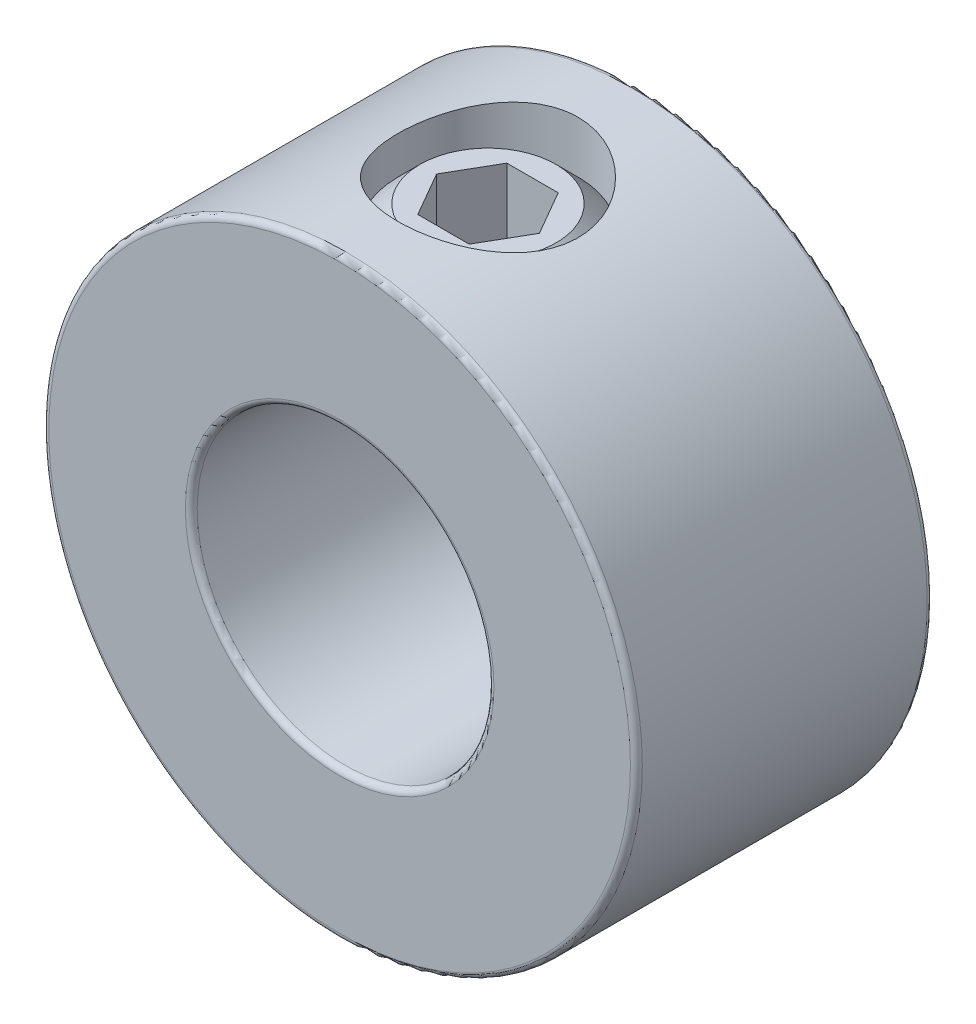
ISO-10303-21;
HEADER;
FILE_DESCRIPTION(('STEP AP214'),'2;1');
FILE_NAME('part.step','',(''),(''),'','','');
FILE_SCHEMA(('AUTOMOTIVE_DESIGN { 1 0 10303 214 1 1 1 1 }'));
ENDSEC;
DATA;
#1=APPLICATION_CONTEXT('core data for automotive mechanical design processes');
#2=APPLICATION_PROTOCOL_DEFINITION('international standard','automotive_design',2000,#1);
#3=PRODUCT_CONTEXT('',#1,'mechanical');
#4=PRODUCT('Part','Part','',(#3));
#5=PRODUCT_RELATED_PRODUCT_CATEGORY('part','',(#4));
#6=PRODUCT_DEFINITION_FORMATION('','',#4);
#7=PRODUCT_DEFINITION_CONTEXT('part definition',#1,'design');
#8=PRODUCT_DEFINITION('design','',#6,#7);
#9=PRODUCT_DEFINITION_SHAPE('','',#8);
#10=(LENGTH_UNIT() NAMED_UNIT(*) SI_UNIT(.MILLI.,.METRE.));
#11=(NAMED_UNIT(*) PLANE_ANGLE_UNIT() SI_UNIT($,.RADIAN.));
#12=(NAMED_UNIT(*) SI_UNIT($,.STERADIAN.) SOLID_ANGLE_UNIT());
#13=UNCERTAINTY_MEASURE_WITH_UNIT(LENGTH_MEASURE(1.E-05),#10,'distance_accuracy_value','');
#14=(GEOMETRIC_REPRESENTATION_CONTEXT(3) GLOBAL_UNCERTAINTY_ASSIGNED_CONTEXT((#13)) GLOBAL_UNIT_ASSIGNED_CONTEXT((#10,
#11,#12)) REPRESENTATION_CONTEXT('',''));
#15=CARTESIAN_POINT('',(0.,0.,0.));
#16=DIRECTION('',(0.,0.,1.));
#17=DIRECTION('',(1.,0.,0.));
#18=AXIS2_PLACEMENT_3D('',#15,#16,#17);
#19=CARTESIAN_POINT('',(0.,7.14375,0.));
#20=DIRECTION('',(0.,1.,0.));
#21=DIRECTION('',(-1.,0.,0.));
#22=AXIS2_PLACEMENT_3D('',#19,#20,#21);
#23=PLANE('',#22);
#24=CARTESIAN_POINT('',(0.,7.14375,0.));
#25=DIRECTION('',(0.,1.,0.));
#26=DIRECTION('',(-1.,0.,0.));
#27=AXIS2_PLACEMENT_3D('',#24,#25,#26);
#28=CIRCLE('',#27,1.81975161629017);
#29=CARTESIAN_POINT('',(-1.81975161629017,7.14375,0.));
#30=VERTEX_POINT('',#29);
#31=EDGE_CURVE('E12',#30,#30,#28,.T.);
#32=ORIENTED_EDGE('',*,*,#31,.T.);
#33=EDGE_LOOP('',(#32));
#34=FACE_BOUND('',#33,.T.);
#35=DIRECTION('',(1.,0.,0.));
#36=VECTOR('',#35,1.);
#37=CARTESIAN_POINT('',(-0.687407664253899,7.14374999999999,-1.190625));
#38=LINE('',#37,#36);
#39=CARTESIAN_POINT('',(-0.687407664253899,7.14374999999999,-1.190625));
#40=VERTEX_POINT('',#39);
#41=CARTESIAN_POINT('',(0.687407664253899,7.14375,-1.190625));
#42=VERTEX_POINT('',#41);
#43=EDGE_CURVE('E124',#40,#42,#38,.T.);
#44=ORIENTED_EDGE('',*,*,#43,.T.);
#45=DIRECTION('',(0.5,0.,0.866025403784439));
#46=VECTOR('',#45,1.);
#47=CARTESIAN_POINT('',(0.687407664253899,7.14374999999999,-1.190625));
#48=LINE('',#47,#46);
#49=CARTESIAN_POINT('',(1.3748153285078,7.14374999999999,0.));
#50=VERTEX_POINT('',#49);
#51=EDGE_CURVE('E68',#42,#50,#48,.T.);
#52=ORIENTED_EDGE('',*,*,#51,.T.);
#53=DIRECTION('',(-0.5,0.,0.866025403784439));
#54=VECTOR('',#53,1.);
#55=CARTESIAN_POINT('',(1.3748153285078,7.14374999999999,0.));
#56=LINE('',#55,#54);
#57=CARTESIAN_POINT('',(0.687407664253899,7.14374999999999,1.190625));
#58=VERTEX_POINT('',#57);
#59=EDGE_CURVE('E128',#50,#58,#56,.T.);
#60=ORIENTED_EDGE('',*,*,#59,.T.);
#61=DIRECTION('',(-1.,0.,0.));
#62=VECTOR('',#61,1.);
#63=CARTESIAN_POINT('',(0.687407664253899,7.14374999999999,1.190625));
#64=LINE('',#63,#62);
#65=CARTESIAN_POINT('',(-0.687407664253899,7.14374999999999,1.190625));
#66=VERTEX_POINT('',#65);
#67=EDGE_CURVE('E207',#58,#66,#64,.T.);
#68=ORIENTED_EDGE('',*,*,#67,.T.);
#69=DIRECTION('',(-0.5,0.,-0.866025403784439));
#70=VECTOR('',#69,1.);
#71=CARTESIAN_POINT('',(-0.687407664253899,7.14374999999999,1.190625));
#72=LINE('',#71,#70);
#73=CARTESIAN_POINT('',(-1.3748153285078,7.14374999999999,0.));
#74=VERTEX_POINT('',#73);
#75=EDGE_CURVE('E187',#66,#74,#72,.T.);
#76=ORIENTED_EDGE('',*,*,#75,.T.);
#77=DIRECTION('',(0.5,0.,-0.866025403784439));
#78=VECTOR('',#77,1.);
#79=CARTESIAN_POINT('',(-1.3748153285078,7.14374999999999,0.));
#80=LINE('',#79,#78);
#81=EDGE_CURVE('E180',#74,#40,#80,.T.);
#82=ORIENTED_EDGE('',*,*,#81,.T.);
#83=EDGE_LOOP('',(#44,#52,#60,#68,#76,#82));
#84=FACE_BOUND('',#83,.T.);
#85=ADVANCED_FACE('F53',(#34,#84),#23,.T.);
#86=CARTESIAN_POINT('',(0.,7.14375,0.));
#87=DIRECTION('',(0.,-1.,0.));
#88=DIRECTION('',(1.,0.,0.));
#89=AXIS2_PLACEMENT_3D('',#86,#87,#88);
#90=CONICAL_SURFACE('',#89,1.81975161629017,0.785398163397449);
#91=CARTESIAN_POINT('',(0.,6.55050161629017,0.));
#92=DIRECTION('',(0.,1.,0.));
#93=DIRECTION('',(-1.,0.,0.));
#94=AXIS2_PLACEMENT_3D('',#91,#92,#93);
#95=CIRCLE('',#94,2.413);
#96=CARTESIAN_POINT('',(-2.413,6.55050161629017,0.));
#97=VERTEX_POINT('',#96);
#98=EDGE_CURVE('E61',#97,#97,#95,.T.);
#99=ORIENTED_EDGE('',*,*,#98,.T.);
#100=EDGE_LOOP('',(#99));
#101=FACE_BOUND('',#100,.T.);
#102=ORIENTED_EDGE('',*,*,#31,.F.);
#103=EDGE_LOOP('',(#102));
#104=FACE_BOUND('',#103,.T.);
#105=ADVANCED_FACE('F154',(#101,#104),#90,.T.);
#106=CARTESIAN_POINT('',(0.,3.96875,0.));
#107=DIRECTION('',(0.,1.,0.));
#108=DIRECTION('',(-1.,0.,0.));
#109=AXIS2_PLACEMENT_3D('',#106,#107,#108);
#110=CYLINDRICAL_SURFACE('',#109,2.413);
#111=CARTESIAN_POINT('',(0.,4.56199838370983,0.));
#112=DIRECTION('',(0.,1.,0.));
#113=DIRECTION('',(-1.,0.,0.));
#114=AXIS2_PLACEMENT_3D('',#111,#112,#113);
#115=CIRCLE('',#114,2.413);
#116=CARTESIAN_POINT('',(-2.413,4.56199838370983,0.));
#117=VERTEX_POINT('',#116);
#118=EDGE_CURVE('E146',#117,#117,#115,.T.);
#119=ORIENTED_EDGE('',*,*,#118,.T.);
#120=EDGE_LOOP('',(#119));
#121=FACE_BOUND('',#120,.T.);
#122=ORIENTED_EDGE('',*,*,#98,.F.);
#123=EDGE_LOOP('',(#122));
#124=FACE_BOUND('',#123,.T.);
#125=ADVANCED_FACE('F157',(#121,#124),#110,.T.);
#126=CARTESIAN_POINT('',(0.,4.56199838370983,0.));
#127=DIRECTION('',(0.,1.,0.));
#128=DIRECTION('',(-1.,0.,0.));
#129=AXIS2_PLACEMENT_3D('',#126,#127,#128);
#130=CONICAL_SURFACE('',#129,2.413,0.785398163397449);
#131=CARTESIAN_POINT('',(0.,3.96875,0.));
#132=DIRECTION('',(0.,1.,0.));
#133=DIRECTION('',(-1.,0.,0.));
#134=AXIS2_PLACEMENT_3D('',#131,#132,#133);
#135=CIRCLE('',#134,1.81975161629017);
#136=CARTESIAN_POINT('',(-1.81975161629017,3.96875,0.));
#137=VERTEX_POINT('',#136);
#138=EDGE_CURVE('E137',#137,#137,#135,.T.);
#139=ORIENTED_EDGE('',*,*,#138,.T.);
#140=EDGE_LOOP('',(#139));
#141=FACE_BOUND('',#140,.T.);
#142=ORIENTED_EDGE('',*,*,#118,.F.);
#143=EDGE_LOOP('',(#142));
#144=FACE_BOUND('',#143,.T.);
#145=ADVANCED_FACE('F159',(#141,#144),#130,.T.);
#146=CARTESIAN_POINT('',(-1.81975161629017,3.96875,0.));
#147=DIRECTION('',(0.,-1.,0.));
#148=DIRECTION('',(1.,0.,0.));
#149=AXIS2_PLACEMENT_3D('',#146,#147,#148);
#150=PLANE('',#149);
#151=CARTESIAN_POINT('',(0.,3.96875,0.));
#152=DIRECTION('',(0.,1.,0.));
#153=DIRECTION('',(-1.,0.,0.));
#154=AXIS2_PLACEMENT_3D('',#151,#152,#153);
#155=CIRCLE('',#154,0.711898060451796);
#156=CARTESIAN_POINT('',(-0.711898060451796,3.96875,0.));
#157=VERTEX_POINT('',#156);
#158=EDGE_CURVE('E130',#157,#157,#155,.T.);
#159=ORIENTED_EDGE('',*,*,#158,.T.);
#160=EDGE_LOOP('',(#159));
#161=FACE_BOUND('',#160,.T.);
#162=ORIENTED_EDGE('',*,*,#138,.F.);
#163=EDGE_LOOP('',(#162));
#164=FACE_BOUND('',#163,.T.);
#165=ADVANCED_FACE('F166',(#161,#164),#150,.T.);
#166=CARTESIAN_POINT('',(0.,3.96875,0.));
#167=DIRECTION('',(0.,-1.,0.));
#168=DIRECTION('',(1.,0.,0.));
#169=AXIS2_PLACEMENT_3D('',#166,#167,#168);
#170=CONICAL_SURFACE('',#169,0.711898060451796,0.785398163397448);
#171=CARTESIAN_POINT('',(0.,4.6806480604518,0.));
#172=VERTEX_POINT('',#171);
#173=VERTEX_LOOP('',#172);
#174=FACE_BOUND('',#173,.T.);
#175=ORIENTED_EDGE('',*,*,#158,.F.);
#176=EDGE_LOOP('',(#175));
#177=FACE_BOUND('',#176,.T.);
#178=ADVANCED_FACE('F259',(#174,#177),#170,.F.);
#179=CARTESIAN_POINT('',(0.687407664253899,4.76249999999999,-1.190625));
#180=DIRECTION('',(-0.866025403784439,0.,0.5));
#181=DIRECTION('',(0.5,0.,0.866025403784438));
#182=AXIS2_PLACEMENT_3D('',#179,#180,#181);
#183=PLANE('',#182);
#184=ORIENTED_EDGE('',*,*,#51,.F.);
#185=DIRECTION('',(0.,1.,0.));
#186=VECTOR('',#185,1.);
#187=CARTESIAN_POINT('',(0.687407664253899,4.76249999999999,-1.190625));
#188=LINE('',#187,#186);
#189=CARTESIAN_POINT('',(0.687407664253899,4.76249999999999,-1.190625));
#190=VERTEX_POINT('',#189);
#191=EDGE_CURVE('E122',#190,#42,#188,.T.);
#192=ORIENTED_EDGE('',*,*,#191,.F.);
#193=DIRECTION('',(0.5,0.,0.866025403784439));
#194=VECTOR('',#193,1.);
#195=CARTESIAN_POINT('',(0.687407664253899,4.76249999999999,-1.190625));
#196=LINE('',#195,#194);
#197=CARTESIAN_POINT('',(1.3748153285078,4.76249999999999,0.));
#198=VERTEX_POINT('',#197);
#199=EDGE_CURVE('E112',#190,#198,#196,.T.);
#200=ORIENTED_EDGE('',*,*,#199,.T.);
#201=DIRECTION('',(0.,1.,0.));
#202=VECTOR('',#201,1.);
#203=CARTESIAN_POINT('',(1.3748153285078,4.76249999999999,0.));
#204=LINE('',#203,#202);
#205=EDGE_CURVE('E121',#198,#50,#204,.T.);
#206=ORIENTED_EDGE('',*,*,#205,.T.);
#207=EDGE_LOOP('',(#184,#192,#200,#206));
#208=FACE_BOUND('',#207,.T.);
#209=ADVANCED_FACE('F120',(#208),#183,.T.);
#210=CARTESIAN_POINT('',(1.3748153285078,4.76249999999999,0.));
#211=DIRECTION('',(-0.866025403784439,0.,-0.5));
#212=DIRECTION('',(-0.5,0.,0.866025403784439));
#213=AXIS2_PLACEMENT_3D('',#210,#211,#212);
#214=PLANE('',#213);
#215=ORIENTED_EDGE('',*,*,#59,.F.);
#216=ORIENTED_EDGE('',*,*,#205,.F.);
#217=DIRECTION('',(-0.5,0.,0.866025403784439));
#218=VECTOR('',#217,1.);
#219=CARTESIAN_POINT('',(1.3748153285078,4.76249999999999,0.));
#220=LINE('',#219,#218);
#221=CARTESIAN_POINT('',(0.687407664253899,4.76249999999999,1.190625));
#222=VERTEX_POINT('',#221);
#223=EDGE_CURVE('E108',#198,#222,#220,.T.);
#224=ORIENTED_EDGE('',*,*,#223,.T.);
#225=DIRECTION('',(0.,1.,0.));
#226=VECTOR('',#225,1.);
#227=CARTESIAN_POINT('',(0.687407664253899,4.76249999999999,1.190625));
#228=LINE('',#227,#226);
#229=EDGE_CURVE('E131',#222,#58,#228,.T.);
#230=ORIENTED_EDGE('',*,*,#229,.T.);
#231=EDGE_LOOP('',(#215,#216,#224,#230));
#232=FACE_BOUND('',#231,.T.);
#233=ADVANCED_FACE('F126',(#232),#214,.T.);
#234=CARTESIAN_POINT('',(0.687407664253899,4.76249999999999,1.190625));
#235=DIRECTION('',(0.,0.,-1.));
#236=DIRECTION('',(-1.,0.,0.));
#237=AXIS2_PLACEMENT_3D('',#234,#235,#236);
#238=PLANE('',#237);
#239=ORIENTED_EDGE('',*,*,#67,.F.);
#240=ORIENTED_EDGE('',*,*,#229,.F.);
#241=DIRECTION('',(-1.,0.,0.));
#242=VECTOR('',#241,1.);
#243=CARTESIAN_POINT('',(0.687407664253899,4.76249999999999,1.190625));
#244=LINE('',#243,#242);
#245=CARTESIAN_POINT('',(-0.687407664253899,4.76249999999999,1.190625));
#246=VERTEX_POINT('',#245);
#247=EDGE_CURVE('E114',#222,#246,#244,.T.);
#248=ORIENTED_EDGE('',*,*,#247,.T.);
#249=DIRECTION('',(0.,1.,0.));
#250=VECTOR('',#249,1.);
#251=CARTESIAN_POINT('',(-0.687407664253899,4.76249999999999,1.190625));
#252=LINE('',#251,#250);
#253=EDGE_CURVE('E139',#246,#66,#252,.T.);
#254=ORIENTED_EDGE('',*,*,#253,.T.);
#255=EDGE_LOOP('',(#239,#240,#248,#254));
#256=FACE_BOUND('',#255,.T.);
#257=ADVANCED_FACE('F205',(#256),#238,.T.);
#258=CARTESIAN_POINT('',(-0.687407664253899,4.76249999999999,1.190625));
#259=DIRECTION('',(0.866025403784439,0.,-0.5));
#260=DIRECTION('',(-0.5,0.,-0.866025403784438));
#261=AXIS2_PLACEMENT_3D('',#258,#259,#260);
#262=PLANE('',#261);
#263=ORIENTED_EDGE('',*,*,#75,.F.);
#264=ORIENTED_EDGE('',*,*,#253,.F.);
#265=DIRECTION('',(-0.5,0.,-0.866025403784439));
#266=VECTOR('',#265,1.);
#267=CARTESIAN_POINT('',(-0.687407664253899,4.76249999999999,1.190625));
#268=LINE('',#267,#266);
#269=CARTESIAN_POINT('',(-1.3748153285078,4.76249999999999,0.));
#270=VERTEX_POINT('',#269);
#271=EDGE_CURVE('E225',#246,#270,#268,.T.);
#272=ORIENTED_EDGE('',*,*,#271,.T.);
#273=DIRECTION('',(0.,1.,0.));
#274=VECTOR('',#273,1.);
#275=CARTESIAN_POINT('',(-1.3748153285078,4.76249999999999,0.));
#276=LINE('',#275,#274);
#277=EDGE_CURVE('E197',#270,#74,#276,.T.);
#278=ORIENTED_EDGE('',*,*,#277,.T.);
#279=EDGE_LOOP('',(#263,#264,#272,#278));
#280=FACE_BOUND('',#279,.T.);
#281=ADVANCED_FACE('F209',(#280),#262,.T.);
#282=CARTESIAN_POINT('',(-1.3748153285078,4.76249999999999,0.));
#283=DIRECTION('',(0.866025403784439,0.,0.5));
#284=DIRECTION('',(0.5,0.,-0.866025403784439));
#285=AXIS2_PLACEMENT_3D('',#282,#283,#284);
#286=PLANE('',#285);
#287=ORIENTED_EDGE('',*,*,#81,.F.);
#288=ORIENTED_EDGE('',*,*,#277,.F.);
#289=DIRECTION('',(0.5,0.,-0.866025403784439));
#290=VECTOR('',#289,1.);
#291=CARTESIAN_POINT('',(-1.3748153285078,4.76249999999999,0.));
#292=LINE('',#291,#290);
#293=CARTESIAN_POINT('',(-0.687407664253899,4.76249999999999,-1.190625));
#294=VERTEX_POINT('',#293);
#295=EDGE_CURVE('E222',#270,#294,#292,.T.);
#296=ORIENTED_EDGE('',*,*,#295,.T.);
#297=DIRECTION('',(0.,1.,0.));
#298=VECTOR('',#297,1.);
#299=CARTESIAN_POINT('',(-0.687407664253899,4.76249999999999,-1.190625));
#300=LINE('',#299,#298);
#301=EDGE_CURVE('E193',#294,#40,#300,.T.);
#302=ORIENTED_EDGE('',*,*,#301,.T.);
#303=EDGE_LOOP('',(#287,#288,#296,#302));
#304=FACE_BOUND('',#303,.T.);
#305=ADVANCED_FACE('F240',(#304),#286,.T.);
#306=CARTESIAN_POINT('',(-0.687407664253899,4.76249999999999,-1.190625));
#307=DIRECTION('',(0.,0.,1.));
#308=DIRECTION('',(1.,0.,0.));
#309=AXIS2_PLACEMENT_3D('',#306,#307,#308);
#310=PLANE('',#309);
#311=ORIENTED_EDGE('',*,*,#43,.F.);
#312=ORIENTED_EDGE('',*,*,#301,.F.);
#313=DIRECTION('',(1.,0.,0.));
#314=VECTOR('',#313,1.);
#315=CARTESIAN_POINT('',(-0.687407664253899,4.76249999999999,-1.190625));
#316=LINE('',#315,#314);
#317=EDGE_CURVE('E194',#294,#190,#316,.T.);
#318=ORIENTED_EDGE('',*,*,#317,.T.);
#319=ORIENTED_EDGE('',*,*,#191,.T.);
#320=EDGE_LOOP('',(#311,#312,#318,#319));
#321=FACE_BOUND('',#320,.T.);
#322=ADVANCED_FACE('F241',(#321),#310,.T.);
#323=CARTESIAN_POINT('',(1.3748153285078,4.76249999999999,0.));
#324=DIRECTION('',(0.,-1.,0.));
#325=DIRECTION('',(0.,0.,-1.));
#326=AXIS2_PLACEMENT_3D('',#323,#324,#325);
#327=PLANE('',#326);
#328=ORIENTED_EDGE('',*,*,#199,.F.);
#329=ORIENTED_EDGE('',*,*,#317,.F.);
#330=ORIENTED_EDGE('',*,*,#295,.F.);
#331=ORIENTED_EDGE('',*,*,#271,.F.);
#332=ORIENTED_EDGE('',*,*,#247,.F.);
#333=ORIENTED_EDGE('',*,*,#223,.F.);
#334=EDGE_LOOP('',(#328,#329,#330,#331,#332,#333));
#335=FACE_BOUND('',#334,.T.);
#336=ADVANCED_FACE('F110',(#335),#327,.F.);
#337=CLOSED_SHELL('',(#85,#105,#125,#145,#165,#178,#209,#233,#257,#281,#305,#322,#336));
#338=MANIFOLD_SOLID_BREP('B2',#337);
#339=CARTESIAN_POINT('',(0.,0.,3.96875));
#340=DIRECTION('',(0.,0.,1.));
#341=DIRECTION('',(1.,0.,0.));
#342=AXIS2_PLACEMENT_3D('',#339,#340,#341);
#343=PLANE('',#342);
#344=CARTESIAN_POINT('',(0.,0.,3.96875));
#345=DIRECTION('',(0.,0.,1.));
#346=DIRECTION('',(1.,0.,0.));
#347=AXIS2_PLACEMENT_3D('',#344,#345,#346);
#348=CIRCLE('',#347,4.1275);
#349=CARTESIAN_POINT('',(4.1275,0.,3.96875));
#350=VERTEX_POINT('',#349);
#351=EDGE_CURVE('E368',#350,#350,#348,.F.);
#352=ORIENTED_EDGE('',*,*,#351,.T.);
#353=EDGE_LOOP('',(#352));
#354=FACE_BOUND('',#353,.T.);
#355=CARTESIAN_POINT('',(0.,0.,3.96875));
#356=DIRECTION('',(0.,0.,1.));
#357=DIRECTION('',(1.,0.,0.));
#358=AXIS2_PLACEMENT_3D('',#355,#356,#357);
#359=CIRCLE('',#358,7.77875);
#360=CARTESIAN_POINT('',(7.77875,0.,3.96875));
#361=VERTEX_POINT('',#360);
#362=EDGE_CURVE('E374',#361,#361,#359,.T.);
#363=ORIENTED_EDGE('',*,*,#362,.T.);
#364=EDGE_LOOP('',(#363));
#365=FACE_BOUND('',#364,.T.);
#366=ADVANCED_FACE('F354',(#354,#365),#343,.T.);
#367=CARTESIAN_POINT('',(0.,0.,-3.96875));
#368=DIRECTION('',(0.,0.,1.));
#369=DIRECTION('',(1.,0.,0.));
#370=AXIS2_PLACEMENT_3D('',#367,#368,#369);
#371=PLANE('',#370);
#372=CARTESIAN_POINT('',(0.,0.,-3.96875));
#373=DIRECTION('',(0.,0.,1.));
#374=DIRECTION('',(1.,0.,0.));
#375=AXIS2_PLACEMENT_3D('',#372,#373,#374);
#376=CIRCLE('',#375,4.1275);
#377=CARTESIAN_POINT('',(4.1275,0.,-3.96875));
#378=VERTEX_POINT('',#377);
#379=EDGE_CURVE('E388',#378,#378,#376,.T.);
#380=ORIENTED_EDGE('',*,*,#379,.T.);
#381=EDGE_LOOP('',(#380));
#382=FACE_BOUND('',#381,.T.);
#383=CARTESIAN_POINT('',(0.,0.,-3.96875));
#384=DIRECTION('',(0.,0.,1.));
#385=DIRECTION('',(1.,0.,0.));
#386=AXIS2_PLACEMENT_3D('',#383,#384,#385);
#387=CIRCLE('',#386,7.77875);
#388=CARTESIAN_POINT('',(7.77875,0.,-3.96875));
#389=VERTEX_POINT('',#388);
#390=EDGE_CURVE('E392',#389,#389,#387,.F.);
#391=ORIENTED_EDGE('',*,*,#390,.T.);
#392=EDGE_LOOP('',(#391));
#393=FACE_BOUND('',#392,.T.);
#394=ADVANCED_FACE('F430',(#382,#393),#371,.F.);
#395=CARTESIAN_POINT('',(0.,0.,3.96875));
#396=DIRECTION('',(0.,0.,-1.));
#397=DIRECTION('',(-1.,0.,0.));
#398=AXIS2_PLACEMENT_3D('',#395,#396,#397);
#399=CYLINDRICAL_SURFACE('',#398,7.9375);
#400=CARTESIAN_POINT('',(0.,0.,-3.81));
#401=DIRECTION('',(0.,0.,1.));
#402=DIRECTION('',(1.,0.,0.));
#403=AXIS2_PLACEMENT_3D('',#400,#401,#402);
#404=CIRCLE('',#403,7.9375);
#405=CARTESIAN_POINT('',(7.9375,0.,-3.81));
#406=VERTEX_POINT('',#405);
#407=EDGE_CURVE('E52',#406,#406,#404,.T.);
#408=ORIENTED_EDGE('',*,*,#407,.T.);
#409=EDGE_LOOP('',(#408));
#410=FACE_BOUND('',#409,.T.);
#411=CARTESIAN_POINT('',(0.,0.,3.81));
#412=DIRECTION('',(0.,0.,1.));
#413=DIRECTION('',(1.,0.,0.));
#414=AXIS2_PLACEMENT_3D('',#411,#412,#413);
#415=CIRCLE('',#414,7.9375);
#416=CARTESIAN_POINT('',(7.9375,0.,3.81));
#417=VERTEX_POINT('',#416);
#418=EDGE_CURVE('E362',#417,#417,#415,.F.);
#419=ORIENTED_EDGE('',*,*,#418,.T.);
#420=EDGE_LOOP('',(#419));
#421=FACE_BOUND('',#420,.T.);
#422=CARTESIAN_POINT('',(0.,7.9375,-2.413));
#423=CARTESIAN_POINT('',(0.132292774899317,7.9374990050537,-2.41299862237628));
#424=CARTESIAN_POINT('',(0.264599518381689,7.93416116207132,-2.40208456794969));
#425=CARTESIAN_POINT('',(0.525354946013904,7.92117222946042,-2.35882374345716));
#426=CARTESIAN_POINT('',(0.653802557415082,7.91151940108894,-2.32647107053551));
#427=CARTESIAN_POINT('',(0.903041313331836,7.88695717599938,-2.24151680045489));
#428=CARTESIAN_POINT('',(1.0238436159252,7.87205565851205,-2.18894554423122));
#429=CARTESIAN_POINT('',(1.25491860814633,7.83854164816898,-2.06517231127943));
#430=CARTESIAN_POINT('',(1.36518981088764,7.81992863242886,-1.99396770900084));
#431=CARTESIAN_POINT('',(1.5753146010731,7.78036198161428,-1.83274390297987));
#432=CARTESIAN_POINT('',(1.67481494525514,7.75935941289957,-1.74227635763322));
#433=CARTESIAN_POINT('',(1.85749109856336,7.71766998618262,-1.54604996654896));
#434=CARTESIAN_POINT('',(1.9406640704021,7.69698318362761,-1.44028846864199));
#435=CARTESIAN_POINT('',(2.09020118290126,7.65774749745578,-1.21346560478497));
#436=CARTESIAN_POINT('',(2.15613096597831,7.63925929192144,-1.09210639523313));
#437=CARTESIAN_POINT('',(2.26650098404084,7.60724691943917,-0.839370407786386));
#438=CARTESIAN_POINT('',(2.31094653649145,7.59372152436824,-0.707996118007792));
#439=CARTESIAN_POINT('',(2.3758067264602,7.57367670858706,-0.442932068104457));
#440=CARTESIAN_POINT('',(2.39687388308448,7.56696751920921,-0.309416717357086));
#441=CARTESIAN_POINT('',(2.4164171516007,7.56075056418472,-0.0405910256843933));
#442=CARTESIAN_POINT('',(2.41489890338842,7.56124100068904,0.0947188586885998));
#443=CARTESIAN_POINT('',(2.38982629949606,7.56919991114954,0.357957705592921));
#444=CARTESIAN_POINT('',(2.36709319986061,7.57640830969674,0.485974062421038));
#445=CARTESIAN_POINT('',(2.30156455882043,7.59656963695107,0.736282348204517));
#446=CARTESIAN_POINT('',(2.25876698945115,7.60952314632332,0.858573697144985));
#447=CARTESIAN_POINT('',(2.15372728275048,7.63992010283533,1.09595275882303));
#448=CARTESIAN_POINT('',(2.09122148030352,7.65742383164637,1.21091575085397));
#449=CARTESIAN_POINT('',(1.94872282727374,7.6949204514905,1.42899447413862));
#450=CARTESIAN_POINT('',(1.86872564146393,7.71491395908373,1.53210725864378));
#451=CARTESIAN_POINT('',(1.68945173313376,7.75618852856768,1.72821183511834));
#452=CARTESIAN_POINT('',(1.58949459558667,7.77748801126888,1.82057882521009));
#453=CARTESIAN_POINT('',(1.37524410592773,7.81821490430143,1.98738656746316));
#454=CARTESIAN_POINT('',(1.26094980324712,7.83764219035306,2.0618261300612));
#455=CARTESIAN_POINT('',(1.0201121910355,7.87262138541946,2.19105912538642));
#456=CARTESIAN_POINT('',(0.893488365352983,7.88814506930487,2.24571066163077));
#457=CARTESIAN_POINT('',(0.632264385940609,7.91336446499524,2.3327557354663));
#458=CARTESIAN_POINT('',(0.497666531143089,7.92306184764078,2.36515565465833));
#459=CARTESIAN_POINT('',(0.229624252219485,7.93527028493288,2.40572996828062));
#460=CARTESIAN_POINT('',(0.09631920362542,7.93803232635549,2.41475084587308));
#461=CARTESIAN_POINT('',(-0.169910326320387,7.93679710103237,2.41068803034094));
#462=CARTESIAN_POINT('',(-0.30283485746222,7.93280076329333,2.39760737529289));
#463=CARTESIAN_POINT('',(-0.561313045757695,7.918662317796,2.35039574306306));
#464=CARTESIAN_POINT('',(-0.686966276089901,7.9086655503028,2.31676225166702));
#465=CARTESIAN_POINT('',(-0.930816403381333,7.88368716256098,2.23000090507394));
#466=CARTESIAN_POINT('',(-1.04901239362654,7.86870493752267,2.17687068463324));
#467=CARTESIAN_POINT('',(-1.27768494619444,7.83486511139573,2.05122165093958));
#468=CARTESIAN_POINT('',(-1.38791430468818,7.81592458790179,1.97827588105506));
#469=CARTESIAN_POINT('',(-1.59485450866657,7.77634000763052,1.81558313194289));
#470=CARTESIAN_POINT('',(-1.69156186567424,7.75569551343041,1.72583183105413));
#471=CARTESIAN_POINT('',(-1.87245924486539,7.71406179196385,1.52809707336634));
#472=CARTESIAN_POINT('',(-1.95604664764415,7.69308849985636,1.41955774085528));
#473=CARTESIAN_POINT('',(-2.10386717742399,7.65398694583366,1.18953707022205));
#474=CARTESIAN_POINT('',(-2.16810075387635,7.63585861785491,1.06805603273204));
#475=CARTESIAN_POINT('',(-2.27496230406853,7.6047061861998,0.815946913466264));
#476=CARTESIAN_POINT('',(-2.31768600255476,7.59165952754718,0.685362356123388));
#477=CARTESIAN_POINT('',(-2.38040189821885,7.57223163077592,0.418379500826614));
#478=CARTESIAN_POINT('',(-2.40040215315239,7.56584802999566,0.281983281505183));
#479=CARTESIAN_POINT('',(-2.41654573186451,7.56070606206809,0.0135215462387282));
#480=CARTESIAN_POINT('',(-2.41367335403041,7.56163307372804,-0.11847951451985));
#481=CARTESIAN_POINT('',(-2.38651114002636,7.57024895804181,-0.380023066349805));
#482=CARTESIAN_POINT('',(-2.36222220501566,7.57793754618407,-0.509565660633487));
#483=CARTESIAN_POINT('',(-2.29355931064324,7.5989964058365,-0.76085836843846));
#484=CARTESIAN_POINT('',(-2.24945261375918,7.61229093341087,-0.882688328499914));
#485=CARTESIAN_POINT('',(-2.14261496851981,7.64304804543904,-1.11731626044873));
#486=CARTESIAN_POINT('',(-2.07988038265957,7.66051144382583,-1.23011246282902));
#487=CARTESIAN_POINT('',(-1.93482964223909,7.69845124150092,-1.44802165282358));
#488=CARTESIAN_POINT('',(-1.85187057120019,7.71901570680081,-1.55269133387613));
#489=CARTESIAN_POINT('',(-1.66987475949574,7.76042016207134,-1.74694286232239));
#490=CARTESIAN_POINT('',(-1.57083380768261,7.78126022289201,-1.83652074527573));
#491=CARTESIAN_POINT('',(-1.35587248164352,7.82162492221923,-2.00075462812685));
#492=CARTESIAN_POINT('',(-1.239531599163,7.84109057268621,-2.07487627262594));
#493=CARTESIAN_POINT('',(-0.995447775442171,7.87579500420969,-2.20240594981202));
#494=CARTESIAN_POINT('',(-0.867709932888345,7.89103566300204,-2.25582318848638));
#495=CARTESIAN_POINT('',(-0.617657643652073,7.91432673031083,-2.33592468921693));
#496=CARTESIAN_POINT('',(-0.496078219783341,7.92294375396858,-2.364748063768));
#497=CARTESIAN_POINT('',(-0.249669622610166,7.93453035635686,-2.40328467078255));
#498=CARTESIAN_POINT('',(-0.12484103093866,7.93750093890329,-2.41300130002538));
#499=CARTESIAN_POINT('',(0.,7.9375,-2.413));
#500=B_SPLINE_CURVE_WITH_KNOTS('',3,(#422,#423,#424,#425,#426,#427,#428,#429,#430,#431,#432,
#433,#434,#435,#436,#437,#438,#439,#440,#441,#442,#443,#444,#445,#446,#447,#448,#449,#450,#451,
#452,#453,#454,#455,#456,#457,#458,#459,#460,#461,#462,#463,#464,#465,#466,#467,#468,#469,#470,
#471,#472,#473,#474,#475,#476,#477,#478,#479,#480,#481,#482,#483,#484,#485,#486,#487,#488,#489,
#490,#491,#492,#493,#494,#495,#496,#497,#498,#499),.UNSPECIFIED.,.T.,.F.,(4,2,2,2,2,2,2,2,2,2,2,
2,2,2,2,2,2,2,2,2,2,2,2,2,2,2,2,2,2,2,2,2,2,2,2,2,2,2,4),(0.,0.396419658797233,
0.792948512171322,1.18888462342481,1.5848765545249,1.99135590349126,2.39790582595712,
2.81388034303934,3.22975185135954,3.63369866570383,4.03754461049548,4.42637821024115,
4.81525111881571,5.20956461414611,5.60397595080319,6.01532502722272,6.42670139093795,
6.84097182422919,7.25512339812399,7.65405578815865,8.0529333454106,8.44251867756104,
8.83215128784881,9.230955625767,9.62986266023801,10.0436726713234,10.4574730718142,
10.8694153009928,11.2812114094117,11.6753852663269,12.0695425381084,12.4585367217993,
12.8476069151672,13.2511843609796,13.6548676571655,14.0707821958696,14.486511589997,
14.8606683757548,15.2347586382522),.UNSPECIFIED.);
#501=CARTESIAN_POINT('',(0.,7.9375,-2.413));
#502=VERTEX_POINT('',#501);
#503=EDGE_CURVE('E396',#502,#502,#500,.T.);
#504=ORIENTED_EDGE('',*,*,#503,.T.);
#505=EDGE_LOOP('',(#504));
#506=FACE_BOUND('',#505,.T.);
#507=ADVANCED_FACE('F426',(#410,#421,#506),#399,.T.);
#508=CARTESIAN_POINT('',(0.,0.,3.96875));
#509=DIRECTION('',(0.,0.,-1.));
#510=DIRECTION('',(-1.,0.,0.));
#511=AXIS2_PLACEMENT_3D('',#508,#509,#510);
#512=CYLINDRICAL_SURFACE('',#511,3.96875);
#513=CARTESIAN_POINT('',(0.,0.,-3.81));
#514=DIRECTION('',(0.,0.,1.));
#515=DIRECTION('',(1.,0.,0.));
#516=AXIS2_PLACEMENT_3D('',#513,#514,#515);
#517=CIRCLE('',#516,3.96875);
#518=CARTESIAN_POINT('',(3.96875,0.,-3.81));
#519=VERTEX_POINT('',#518);
#520=EDGE_CURVE('E380',#519,#519,#517,.F.);
#521=ORIENTED_EDGE('',*,*,#520,.T.);
#522=EDGE_LOOP('',(#521));
#523=FACE_BOUND('',#522,.T.);
#524=CARTESIAN_POINT('',(0.,0.,3.81));
#525=DIRECTION('',(0.,0.,1.));
#526=DIRECTION('',(1.,0.,0.));
#527=AXIS2_PLACEMENT_3D('',#524,#525,#526);
#528=CIRCLE('',#527,3.96875);
#529=CARTESIAN_POINT('',(3.96875,0.,3.81));
#530=VERTEX_POINT('',#529);
#531=EDGE_CURVE('E384',#530,#530,#528,.T.);
#532=ORIENTED_EDGE('',*,*,#531,.T.);
#533=EDGE_LOOP('',(#532));
#534=FACE_BOUND('',#533,.T.);
#535=CARTESIAN_POINT('',(0.,3.96875,-2.413));
#536=CARTESIAN_POINT('',(0.123165501550284,3.96874204339669,-2.41299124615945));
#537=CARTESIAN_POINT('',(0.246516738261875,3.96295429853951,-2.40350384959746));
#538=CARTESIAN_POINT('',(0.489483664080046,3.94034943987807,-2.36604326559291));
#539=CARTESIAN_POINT('',(0.609090127783646,3.92350703743669,-2.33802769196767));
#540=CARTESIAN_POINT('',(0.840546582386573,3.88049577993341,-2.26510491179092));
#541=CARTESIAN_POINT('',(0.952431828991632,3.8543732029897,-2.22028146179405));
#542=CARTESIAN_POINT('',(1.16673008430404,3.79500971512363,-2.11554934419897));
#543=CARTESIAN_POINT('',(1.26914501361637,3.76177025207777,-2.05564374451438));
#544=CARTESIAN_POINT('',(1.47058753111351,3.687916691379,-1.91729289743173));
#545=CARTESIAN_POINT('',(1.56873586524913,3.64693051913672,-1.83776986476495));
#546=CARTESIAN_POINT('',(1.75115925298086,3.56293790693084,-1.66488233877126));
#547=CARTESIAN_POINT('',(1.83541593933604,3.51992888739431,-1.57149982566307));
#548=CARTESIAN_POINT('',(1.99850147891552,3.43025832872789,-1.35964489661003));
#549=CARTESIAN_POINT('',(2.07529106286855,3.38382416372775,-1.23949270263077));
#550=CARTESIAN_POINT('',(2.20731894277433,3.29922586533873,-0.985260717608268));
#551=CARTESIAN_POINT('',(2.26259272815675,3.26104815989316,-0.851204327616272));
#552=CARTESIAN_POINT('',(2.33806142410285,3.2071858977595,-0.606725086153752));
#553=CARTESIAN_POINT('',(2.3635499927685,3.18827407496012,-0.498650940719577));
#554=CARTESIAN_POINT('',(2.3994244997262,3.16137002399118,-0.27874861563771));
#555=CARTESIAN_POINT('',(2.40983000472769,3.15336364939586,-0.166925492537775));
#556=CARTESIAN_POINT('',(2.41493016649177,3.14946076169536,0.0575392620475352));
#557=CARTESIAN_POINT('',(2.40959091684864,3.15359038345178,0.170182138134826));
#558=CARTESIAN_POINT('',(2.3834758297023,3.17336918561413,0.392656374086385));
#559=CARTESIAN_POINT('',(2.36268812164138,3.18902722434164,0.502485504705744));
#560=CARTESIAN_POINT('',(2.3072582560278,3.22934546748502,0.714839170566954));
#561=CARTESIAN_POINT('',(2.27284136966713,3.2538587555979,0.817452012053584));
#562=CARTESIAN_POINT('',(2.19144263462213,3.30922547315599,1.01569946550598));
#563=CARTESIAN_POINT('',(2.14445623611994,3.34008119745013,1.11133153463737));
#564=CARTESIAN_POINT('',(2.02958239720278,3.41132068401533,1.31107139668459));
#565=CARTESIAN_POINT('',(1.95946010965428,3.45242166708182,1.41363816272798));
#566=CARTESIAN_POINT('',(1.8046098923845,3.53583156997046,1.60663550750143));
#567=CARTESIAN_POINT('',(1.71986762893658,3.57814164091738,1.69705401960805));
#568=CARTESIAN_POINT('',(1.52341346023064,3.66652895599888,1.87670279125692));
#569=CARTESIAN_POINT('',(1.40956777558015,3.71224383147173,1.96379855427126));
#570=CARTESIAN_POINT('',(1.16600981934112,3.79577231057004,2.11746058126192));
#571=CARTESIAN_POINT('',(1.03630546031566,3.83358982922035,2.18403702528473));
#572=CARTESIAN_POINT('',(0.836657404029858,3.88011810238804,2.26436147855773));
#573=CARTESIAN_POINT('',(0.771445792482796,3.89363655503471,2.28741378555035));
#574=CARTESIAN_POINT('',(0.63877705404067,3.91758471873137,2.3279461715394));
#575=CARTESIAN_POINT('',(0.571321220958915,3.92801617627651,2.34542940172032));
#576=CARTESIAN_POINT('',(0.434774063004328,3.94546326769465,2.37453334076451));
#577=CARTESIAN_POINT('',(0.36568406213146,3.95248157377129,2.38615863614474));
#578=CARTESIAN_POINT('',(0.226511162532038,3.96289656392044,2.40336960926214));
#579=CARTESIAN_POINT('',(0.156428414099685,3.966293790382,2.40895619151915));
#580=CARTESIAN_POINT('',(-0.0345875094638976,3.97042803093639,2.41576593447406));
#581=CARTESIAN_POINT('',(-0.155889645087031,3.96750179775886,2.41097308037977));
#582=CARTESIAN_POINT('',(-0.395580786800256,3.95081788580082,2.38341492656171));
#583=CARTESIAN_POINT('',(-0.513969891060856,3.93706057254972,2.36065023335502));
#584=CARTESIAN_POINT('',(-0.741302925101665,3.9005543203932,2.29924007500009));
#585=CARTESIAN_POINT('',(-0.850420645087186,3.87807562396895,2.26107063451517));
#586=CARTESIAN_POINT('',(-1.06064649564909,3.82593168660241,2.17041877534692));
#587=CARTESIAN_POINT('',(-1.16175312592156,3.79626510372601,2.11793368378936));
#588=CARTESIAN_POINT('',(-1.36438293166863,3.72853735621207,1.99412771667006));
#589=CARTESIAN_POINT('',(-1.46487371909966,3.68992598646786,1.92142252874577));
#590=CARTESIAN_POINT('',(-1.6529744799132,3.60958967643982,1.76223036727608));
#591=CARTESIAN_POINT('',(-1.74056936405613,3.56786117353918,1.67572749194951));
#592=CARTESIAN_POINT('',(-1.91261918342017,3.4790009867155,1.47780510411286));
#593=CARTESIAN_POINT('',(-1.99504642611132,3.43190199283522,1.3645979373042));
#594=CARTESIAN_POINT('',(-2.13985097603664,3.34353376432047,1.12395576920229));
#595=CARTESIAN_POINT('',(-2.20224731258024,3.3022590176874,0.99653442736945));
#596=CARTESIAN_POINT('',(-2.29344177866512,3.23936579282098,0.758458757219687));
#597=CARTESIAN_POINT('',(-2.32657866306329,3.2154293082859,0.65008626694079));
#598=CARTESIAN_POINT('',(-2.37744086245656,3.17801315216161,0.428095724280517));
#599=CARTESIAN_POINT('',(-2.39518851540099,3.16451832725394,0.314485527906917));
#600=CARTESIAN_POINT('',(-2.4142849438641,3.14997859909978,0.0845648471209729));
#601=CARTESIAN_POINT('',(-2.41556252659962,3.14898774534438,-0.0317551842091482));
#602=CARTESIAN_POINT('',(-2.40143983741951,3.15976763622633,-0.262802510402487));
#603=CARTESIAN_POINT('',(-2.38603134047097,3.17154467451613,-0.377528991515132));
#604=CARTESIAN_POINT('',(-2.34087808899904,3.20499353082565,-0.595427565837474));
#605=CARTESIAN_POINT('',(-2.31201651153951,3.22605194545112,-0.698883891062723));
#606=CARTESIAN_POINT('',(-2.24159346468759,3.27537424028443,-0.899525378863215));
#607=CARTESIAN_POINT('',(-2.20002713060506,3.30364087985553,-0.996708121970213));
#608=CARTESIAN_POINT('',(-2.09815316530071,3.36941108076951,-1.19787071136103));
#609=CARTESIAN_POINT('',(-2.03595940923333,3.40766534627249,-1.30064658521609));
#610=CARTESIAN_POINT('',(-1.89759243380594,3.48661316283012,-1.49532299960668));
#611=CARTESIAN_POINT('',(-1.8214076316638,3.52730871602022,-1.58721442476447));
#612=CARTESIAN_POINT('',(-1.64167102002946,3.61490729831683,-1.77400508435351));
#613=CARTESIAN_POINT('',(-1.53566353730284,3.66165458052152,-1.8666319309591));
#614=CARTESIAN_POINT('',(-1.30733133465839,3.74923513415245,-2.03306755896813));
#615=CARTESIAN_POINT('',(-1.18499957660471,3.7900658387457,-2.1068681833466));
#616=CARTESIAN_POINT('',(-0.992797970722944,3.84313134813152,-2.20042712586814));
#617=CARTESIAN_POINT('',(-0.927982367310503,3.85933156031422,-2.22855402350391));
#618=CARTESIAN_POINT('',(-0.795559520872516,3.88878496079137,-2.27918148009105));
#619=CARTESIAN_POINT('',(-0.727953929816715,3.90203986415944,-2.30168531434662));
#620=CARTESIAN_POINT('',(-0.590682088323656,3.92516304136075,-2.34067131568996));
#621=CARTESIAN_POINT('',(-0.521022349049394,3.93504097997536,-2.35717067631077));
#622=CARTESIAN_POINT('',(-0.380141200247729,3.95113746830425,-2.38394525421274));
#623=CARTESIAN_POINT('',(-0.308921092705835,3.95735895677176,-2.39422547012538));
#624=CARTESIAN_POINT('',(-0.197911841866967,3.96400880129109,-2.40519582144499));
#625=CARTESIAN_POINT('',(-0.158409536716784,3.96578426665766,-2.40811983856632));
#626=CARTESIAN_POINT('',(-0.0792779074840153,3.96815617484923,-2.41202338329055));
#627=CARTESIAN_POINT('',(-0.0396485774223999,3.96875256133413,-2.41300281797516));
#628=CARTESIAN_POINT('',(0.,3.96875,-2.413));
#629=B_SPLINE_CURVE_WITH_KNOTS('',3,(#535,#536,#537,#538,#539,#540,#541,#542,#543,#544,#545,
#546,#547,#548,#549,#550,#551,#552,#553,#554,#555,#556,#557,#558,#559,#560,#561,#562,#563,#564,
#565,#566,#567,#568,#569,#570,#571,#572,#573,#574,#575,#576,#577,#578,#579,#580,#581,#582,#583,
#584,#585,#586,#587,#588,#589,#590,#591,#592,#593,#594,#595,#596,#597,#598,#599,#600,#601,#602,
#603,#604,#605,#606,#607,#608,#609,#610,#611,#612,#613,#614,#615,#616,#617,#618,#619,#620,#621,
#622,#623,#624,#625,#626,#627,#628),.UNSPECIFIED.,.T.,.F.,(4,2,2,2,2,2,2,2,2,2,2,2,2,2,2,2,2,2,
2,2,2,2,2,2,2,2,2,2,2,2,2,2,2,2,2,2,2,2,2,2,2,2,2,2,2,2,4),(0.,0.369336000212893,
0.739519852105503,1.10788301261231,1.47617130351493,1.87303261988725,2.27041452140817,
2.71812986102281,3.1651035511137,3.50159561421344,3.83765076653255,4.17443014339225,
4.51146856862124,4.84315434981434,5.17496035497859,5.5660827283895,5.95759076835983,
6.40673459073357,6.85565522380449,7.06681388986324,7.27785286161442,7.48872634096565,
7.6995682298635,8.06184669436883,8.42411293315368,8.77595061421479,9.12785403188601,
9.51604919332787,9.90469502451153,10.3459150455,10.786714659617,11.1327806882224,
11.4783435462531,11.8253996203636,12.1726268459717,12.4997183394481,12.826935234491,
13.2037712726917,13.5809207005354,14.0238714599399,14.4670138162992,14.6842067199376,
14.9012728172748,15.1177123721094,15.3339777319336,15.4528661150087,15.5717601788091),.UNSPECIFIED.);
#630=CARTESIAN_POINT('',(0.,3.96875,-2.413));
#631=VERTEX_POINT('',#630);
#632=EDGE_CURVE('E397',#631,#631,#629,.T.);
#633=ORIENTED_EDGE('',*,*,#632,.F.);
#634=EDGE_LOOP('',(#633));
#635=FACE_BOUND('',#634,.T.);
#636=ADVANCED_FACE('F410',(#523,#534,#635),#512,.F.);
#637=CARTESIAN_POINT('',(0.,7.9375,0.));
#638=DIRECTION('',(0.,-1.,0.));
#639=DIRECTION('',(0.,0.,-1.));
#640=AXIS2_PLACEMENT_3D('',#637,#638,#639);
#641=CYLINDRICAL_SURFACE('',#640,2.413);
#642=ORIENTED_EDGE('',*,*,#632,.T.);
#643=EDGE_LOOP('',(#642));
#644=FACE_BOUND('',#643,.T.);
#645=ORIENTED_EDGE('',*,*,#503,.F.);
#646=EDGE_LOOP('',(#645));
#647=FACE_BOUND('',#646,.T.);
#648=ADVANCED_FACE('F413',(#644,#647),#641,.F.);
#649=CARTESIAN_POINT('',(0.,0.,-3.81));
#650=DIRECTION('',(0.,0.,1.));
#651=DIRECTION('',(1.,0.,0.));
#652=AXIS2_PLACEMENT_3D('',#649,#650,#651);
#653=TOROIDAL_SURFACE('',#652,4.1275,0.15875);
#654=ORIENTED_EDGE('',*,*,#520,.F.);
#655=EDGE_LOOP('',(#654));
#656=FACE_BOUND('',#655,.T.);
#657=ORIENTED_EDGE('',*,*,#379,.F.);
#658=EDGE_LOOP('',(#657));
#659=FACE_BOUND('',#658,.T.);
#660=ADVANCED_FACE('F416',(#656,#659),#653,.T.);
#661=CARTESIAN_POINT('',(0.,0.,3.81));
#662=DIRECTION('',(0.,0.,1.));
#663=DIRECTION('',(1.,0.,0.));
#664=AXIS2_PLACEMENT_3D('',#661,#662,#663);
#665=TOROIDAL_SURFACE('',#664,4.1275,0.15875);
#666=ORIENTED_EDGE('',*,*,#351,.F.);
#667=EDGE_LOOP('',(#666));
#668=FACE_BOUND('',#667,.T.);
#669=ORIENTED_EDGE('',*,*,#531,.F.);
#670=EDGE_LOOP('',(#669));
#671=FACE_BOUND('',#670,.T.);
#672=ADVANCED_FACE('F423',(#668,#671),#665,.T.);
#673=CARTESIAN_POINT('',(0.,0.,-3.81));
#674=DIRECTION('',(0.,0.,1.));
#675=DIRECTION('',(1.,0.,0.));
#676=AXIS2_PLACEMENT_3D('',#673,#674,#675);
#677=TOROIDAL_SURFACE('',#676,7.77875,0.15875);
#678=ORIENTED_EDGE('',*,*,#390,.F.);
#679=EDGE_LOOP('',(#678));
#680=FACE_BOUND('',#679,.T.);
#681=ORIENTED_EDGE('',*,*,#407,.F.);
#682=EDGE_LOOP('',(#681));
#683=FACE_BOUND('',#682,.T.);
#684=ADVANCED_FACE('F442',(#680,#683),#677,.T.);
#685=CARTESIAN_POINT('',(0.,0.,3.81));
#686=DIRECTION('',(0.,0.,1.));
#687=DIRECTION('',(1.,0.,0.));
#688=AXIS2_PLACEMENT_3D('',#685,#686,#687);
#689=TOROIDAL_SURFACE('',#688,7.77875,0.15875);
#690=ORIENTED_EDGE('',*,*,#418,.F.);
#691=EDGE_LOOP('',(#690));
#692=FACE_BOUND('',#691,.T.);
#693=ORIENTED_EDGE('',*,*,#362,.F.);
#694=EDGE_LOOP('',(#693));
#695=FACE_BOUND('',#694,.T.);
#696=ADVANCED_FACE('F356',(#692,#695),#689,.T.);
#697=CLOSED_SHELL('',(#366,#394,#507,#636,#648,#660,#672,#684,#696));
#698=MANIFOLD_SOLID_BREP('B6',#697);
#699=ADVANCED_BREP_SHAPE_REPRESENTATION('',(#18,#338,#698),#14);
#700=SHAPE_DEFINITION_REPRESENTATION(#9,#699);
ENDSEC;
END-ISO-10303-21;
